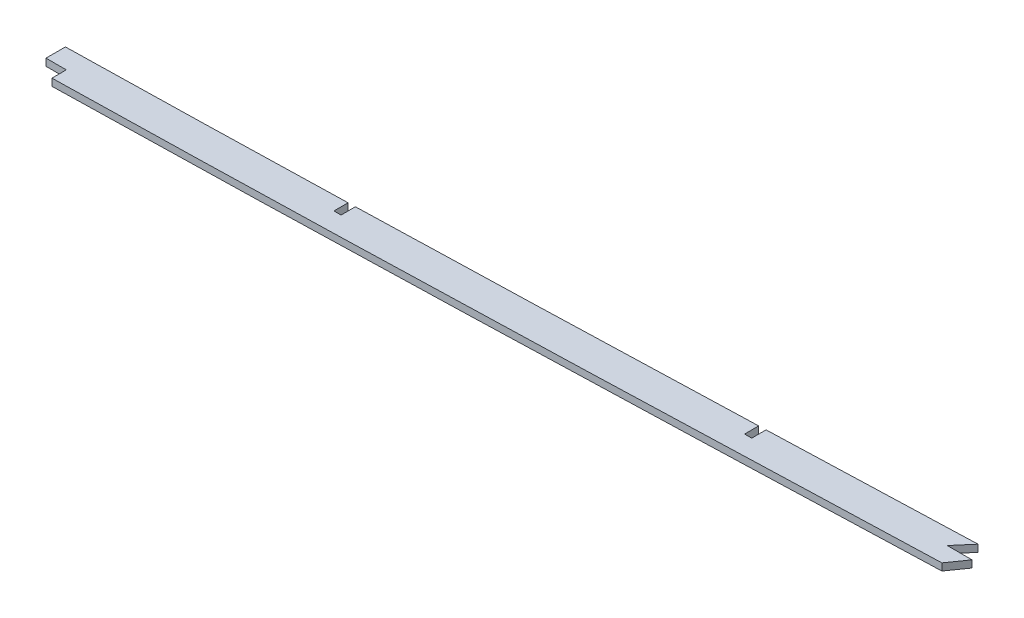
ISO-10303-21;
HEADER;
FILE_DESCRIPTION(('STEP AP214'),'2;1');
FILE_NAME('part.step','',(''),(''),'','','');
FILE_SCHEMA(('AUTOMOTIVE_DESIGN { 1 0 10303 214 1 1 1 1 }'));
ENDSEC;
DATA;
#1=APPLICATION_CONTEXT('core data for automotive mechanical design processes');
#2=APPLICATION_PROTOCOL_DEFINITION('international standard','automotive_design',2000,#1);
#3=PRODUCT_CONTEXT('',#1,'mechanical');
#4=PRODUCT('Part','Part','',(#3));
#5=PRODUCT_RELATED_PRODUCT_CATEGORY('part','',(#4));
#6=PRODUCT_DEFINITION_FORMATION('','',#4);
#7=PRODUCT_DEFINITION_CONTEXT('part definition',#1,'design');
#8=PRODUCT_DEFINITION('design','',#6,#7);
#9=PRODUCT_DEFINITION_SHAPE('','',#8);
#10=(LENGTH_UNIT() NAMED_UNIT(*) SI_UNIT(.MILLI.,.METRE.));
#11=(NAMED_UNIT(*) PLANE_ANGLE_UNIT() SI_UNIT($,.RADIAN.));
#12=(NAMED_UNIT(*) SI_UNIT($,.STERADIAN.) SOLID_ANGLE_UNIT());
#13=UNCERTAINTY_MEASURE_WITH_UNIT(LENGTH_MEASURE(1.E-05),#10,'distance_accuracy_value','');
#14=(GEOMETRIC_REPRESENTATION_CONTEXT(3) GLOBAL_UNCERTAINTY_ASSIGNED_CONTEXT((#13)) GLOBAL_UNIT_ASSIGNED_CONTEXT((#10,
#11,#12)) REPRESENTATION_CONTEXT('',''));
#15=CARTESIAN_POINT('',(0.,0.,0.));
#16=DIRECTION('',(0.,0.,1.));
#17=DIRECTION('',(1.,0.,0.));
#18=AXIS2_PLACEMENT_3D('',#15,#16,#17);
#19=CARTESIAN_POINT('',(616.337750913255,1.5875,99.0566103609531));
#20=CARTESIAN_POINT('',(647.76049660052,1.5875,99.0799542657679));
#21=CARTESIAN_POINT('',(694.87068034325,1.5875,98.960929783245));
#22=CARTESIAN_POINT('',(757.779786958647,1.5875,98.8040630386954));
#23=CARTESIAN_POINT('',(820.69045818609,1.5875,98.7653484328497));
#24=CARTESIAN_POINT('',(899.289299877085,1.5875,98.7967965825531));
#25=CARTESIAN_POINT('',(993.586772551322,1.5875,98.8129149281116));
#26=CARTESIAN_POINT('',(1087.93191592796,1.5875,98.7323574871025));
#27=CARTESIAN_POINT('',(1182.33953079348,1.5875,99.1244994990799));
#28=CARTESIAN_POINT('',(1276.65398068122,1.5875,99.8147611994573));
#29=CARTESIAN_POINT('',(1370.85083148495,1.5875,100.131815232071));
#30=CARTESIAN_POINT('',(1464.98207813977,1.5875,99.4108190462021));
#31=CARTESIAN_POINT('',(1590.54945268054,1.5875,97.1511702631117));
#32=CARTESIAN_POINT('',(1747.54008126415,1.5875,92.7833872927443));
#33=CARTESIAN_POINT('',(1904.58058478476,1.5875,87.4795525069474));
#34=CARTESIAN_POINT('',(2030.20455421821,1.5875,82.9558758992198));
#35=CARTESIAN_POINT('',(2092.98705848864,1.5875,80.5357121207426));
#36=CARTESIAN_POINT('',(2124.37829951673,1.5875,79.2527491986346));
#37=B_SPLINE_CURVE_WITH_KNOTS('',3,(#19,#20,#21,#22,#23,#24,#25,#26,#27,#28,#29,#30,#31,#32,#33,
#34,#35,#36),.UNSPECIFIED.,.F.,.F.,(4,1,1,1,1,1,1,1,1,1,1,1,1,1,1,4),(0.,0.0625,0.09375,0.125,
0.1875,0.25,0.3125,0.375,0.4375,0.5,0.5625,0.625,0.75,0.875,0.9375,1.),.UNSPECIFIED.);
#38=DIRECTION('',(0.,-1.,0.));
#39=VECTOR('',#38,1.);
#40=SURFACE_OF_LINEAR_EXTRUSION('',#37,#39);
#41=DIRECTION('',(0.,-1.,0.));
#42=VECTOR('',#41,1.);
#43=CARTESIAN_POINT('',(1526.14075421475,1.5875,98.2750837700095));
#44=LINE('',#43,#42);
#45=CARTESIAN_POINT('',(1526.14075421475,1.5875,98.2750837700095));
#46=VERTEX_POINT('',#45);
#47=CARTESIAN_POINT('',(1526.14075421818,-1.5875,98.2746680340119));
#48=VERTEX_POINT('',#47);
#49=EDGE_CURVE('E350',#46,#48,#44,.T.);
#50=ORIENTED_EDGE('',*,*,#49,.F.);
#51=CARTESIAN_POINT('',(1649.4125,1.5875,95.4347993689546));
#52=VERTEX_POINT('',#51);
#53=EDGE_CURVE('E189',#46,#52,#37,.T.);
#54=ORIENTED_EDGE('',*,*,#53,.T.);
#55=DIRECTION('',(0.,1.,0.));
#56=VECTOR('',#55,1.);
#57=CARTESIAN_POINT('',(1649.4125,-1.59253086897977,95.4347993689546));
#58=LINE('',#57,#56);
#59=CARTESIAN_POINT('',(1649.41250003793,-1.59001401585944,95.4347979480033));
#60=VERTEX_POINT('',#59);
#61=EDGE_CURVE('E301',#60,#52,#58,.T.);
#62=ORIENTED_EDGE('',*,*,#61,.F.);
#63=CARTESIAN_POINT('',(1649.41250015162,-1.5875,95.434799364902));
#64=CARTESIAN_POINT('',(1619.32619452746,-1.5875,96.2389509414082));
#65=CARTESIAN_POINT('',(1578.23463606875,-1.5875,97.2419981013641));
#66=CARTESIAN_POINT('',(1537.14666468491,-1.5875,98.0688089991976));
#67=CARTESIAN_POINT('',(1526.14075941432,-1.5875,98.2750836725584));
#68=B_SPLINE_CURVE_WITH_KNOTS('',3,(#63,#64,#65,#66,#67),.UNSPECIFIED.,.F.,.F.,(4,1,4),
(0.603087632694586,0.662976353685802,0.684888720991216),.UNSPECIFIED.);
#69=EDGE_CURVE('E194',#48,#60,#68,.F.);
#70=ORIENTED_EDGE('',*,*,#69,.F.);
#71=EDGE_LOOP('',(#50,#54,#62,#70));
#72=FACE_BOUND('',#71,.T.);
#73=ADVANCED_FACE('F40',(#72),#40,.T.);
#74=DIRECTION('',(0.,1.,0.));
#75=VECTOR('',#74,1.);
#76=CARTESIAN_POINT('',(1652.58750000975,-1.59253086897977,95.3496796564228));
#77=LINE('',#76,#75);
#78=CARTESIAN_POINT('',(1652.58750000655,-1.59001537226696,95.349679594262));
#79=VERTEX_POINT('',#78);
#80=CARTESIAN_POINT('',(1652.58750000975,1.5875,95.3496796564228));
#81=VERTEX_POINT('',#80);
#82=EDGE_CURVE('E411',#79,#81,#77,.T.);
#83=ORIENTED_EDGE('',*,*,#82,.T.);
#84=CARTESIAN_POINT('',(1827.2125,1.5875,90.049540748647));
#85=VERTEX_POINT('',#84);
#86=EDGE_CURVE('E186',#81,#85,#37,.T.);
#87=ORIENTED_EDGE('',*,*,#86,.T.);
#88=DIRECTION('',(0.,1.,0.));
#89=VECTOR('',#88,1.);
#90=CARTESIAN_POINT('',(1827.2125,-1.59253086897977,90.049540748647));
#91=LINE('',#90,#89);
#92=CARTESIAN_POINT('',(1827.2124999929,-1.58961570895085,90.0490866715874));
#93=VERTEX_POINT('',#92);
#94=EDGE_CURVE('E400',#93,#85,#91,.T.);
#95=ORIENTED_EDGE('',*,*,#94,.F.);
#96=CARTESIAN_POINT('',(1827.21252585751,-1.5875,90.0495398940868));
#97=CARTESIAN_POINT('',(1800.65723055116,-1.5875,90.9271611648872));
#98=CARTESIAN_POINT('',(1742.44397501687,-1.5875,92.7932630953193));
#99=CARTESIAN_POINT('',(1684.23928773812,-1.5875,94.4985561780462));
#100=CARTESIAN_POINT('',(1652.58750000669,-1.5875,95.3496796565051));
#101=B_SPLINE_CURVE_WITH_KNOTS('',3,(#96,#97,#98,#99,#100),.UNSPECIFIED.,.F.,.F.,(4,1,4),
(0.686995396099414,0.73984185977568,0.802846463676266),.UNSPECIFIED.);
#102=EDGE_CURVE('E457',#79,#93,#101,.F.);
#103=ORIENTED_EDGE('',*,*,#102,.F.);
#104=EDGE_LOOP('',(#83,#87,#95,#103));
#105=FACE_BOUND('',#104,.T.);
#106=ADVANCED_FACE('F276',(#105),#40,.T.);
#107=DIRECTION('',(0.,1.,0.));
#108=VECTOR('',#107,1.);
#109=CARTESIAN_POINT('',(1921.82414159405,-6.0325,86.8230267836531));
#110=LINE('',#109,#108);
#111=CARTESIAN_POINT('',(1921.8241647789,-1.5875,86.8229984790956));
#112=VERTEX_POINT('',#111);
#113=CARTESIAN_POINT('',(1921.82414159405,1.5875,86.8230267836531));
#114=VERTEX_POINT('',#113);
#115=EDGE_CURVE('E157',#112,#114,#110,.T.);
#116=ORIENTED_EDGE('',*,*,#115,.F.);
#117=CARTESIAN_POINT('',(1921.8241898876,-1.5875,86.8230250918403));
#118=CARTESIAN_POINT('',(1891.34525073032,-1.5875,87.890759066566));
#119=CARTESIAN_POINT('',(1860.86587594556,-1.5875,88.9348128638356));
#120=CARTESIAN_POINT('',(1830.38752627754,-1.5875,89.9444847258971));
#121=B_SPLINE_CURVE_WITH_KNOTS('',3,(#117,#118,#119,#120),.UNSPECIFIED.,.F.,.F.,(4,4),
(0.804952601579673,0.865606008921044),.UNSPECIFIED.);
#122=CARTESIAN_POINT('',(1830.38749999487,-1.58961033761423,89.944024452022));
#123=VERTEX_POINT('',#122);
#124=EDGE_CURVE('E300',#123,#112,#121,.F.);
#125=ORIENTED_EDGE('',*,*,#124,.F.);
#126=DIRECTION('',(0.,1.,0.));
#127=VECTOR('',#126,1.);
#128=CARTESIAN_POINT('',(1830.38749999999,-1.59253086897977,89.9444855964069));
#129=LINE('',#128,#127);
#130=CARTESIAN_POINT('',(1830.38749999999,1.5875,89.9444855964069));
#131=VERTEX_POINT('',#130);
#132=EDGE_CURVE('E184',#123,#131,#129,.T.);
#133=ORIENTED_EDGE('',*,*,#132,.T.);
#134=EDGE_CURVE('E176',#131,#114,#37,.T.);
#135=ORIENTED_EDGE('',*,*,#134,.T.);
#136=EDGE_LOOP('',(#116,#125,#133,#135));
#137=FACE_BOUND('',#136,.T.);
#138=ADVANCED_FACE('F183',(#137),#40,.T.);
#139=CARTESIAN_POINT('',(616.326429146063,1.5875,114.296606155493));
#140=CARTESIAN_POINT('',(632.046217380175,1.5875,114.30828435968));
#141=CARTESIAN_POINT('',(647.765968153244,1.5875,114.29677439422));
#142=CARTESIAN_POINT('',(679.205420392794,1.5875,114.24323397025));
#143=CARTESIAN_POINT('',(694.925123066751,1.5875,114.201950932506));
#144=CARTESIAN_POINT('',(726.364532124698,1.5875,114.121681346548));
#145=CARTESIAN_POINT('',(742.084243399862,1.5875,114.083543006226));
#146=CARTESIAN_POINT('',(773.523671882744,1.5875,114.034083388907));
#147=CARTESIAN_POINT('',(789.243390213417,1.5875,114.023396075664));
#148=CARTESIAN_POINT('',(820.682831324826,1.5875,114.017303041489));
#149=CARTESIAN_POINT('',(836.402553623007,1.5875,114.020240225192));
#150=CARTESIAN_POINT('',(867.841997842806,1.5875,114.024821457385));
#151=CARTESIAN_POINT('',(883.561720421664,1.5875,114.028722489467));
#152=CARTESIAN_POINT('',(915.001165910892,1.5875,114.037662965197));
#153=CARTESIAN_POINT('',(930.720888644625,1.5875,114.042095840025));
#154=CARTESIAN_POINT('',(962.160332217753,1.5875,114.044456392842));
#155=CARTESIAN_POINT('',(977.880053630737,1.5875,114.042025852399));
#156=CARTESIAN_POINT('',(1025.03924062521,1.5875,114.02635266127));
#157=CARTESIAN_POINT('',(1056.47872633141,1.5875,114.001081239981));
#158=CARTESIAN_POINT('',(1103.63774370583,1.5875,114.076141518065));
#159=CARTESIAN_POINT('',(1119.35738201238,1.5875,114.119430036675));
#160=CARTESIAN_POINT('',(1150.79658971577,1.5875,114.242868384306));
#161=CARTESIAN_POINT('',(1166.51615941665,1.5875,114.322855573181));
#162=CARTESIAN_POINT('',(1213.67480633689,1.5875,114.596079866728));
#163=CARTESIAN_POINT('',(1245.11381381393,1.5875,114.824335417931));
#164=CARTESIAN_POINT('',(1307.99206873737,1.5875,115.160349224997));
#165=CARTESIAN_POINT('',(1339.43132783757,1.5875,115.262775920084));
#166=CARTESIAN_POINT('',(1386.59071758969,1.5875,115.166774968219));
#167=CARTESIAN_POINT('',(1402.31059775436,1.5875,115.09313610926));
#168=CARTESIAN_POINT('',(1433.75053971329,1.5875,114.855373393272));
#169=CARTESIAN_POINT('',(1449.46971812607,1.5875,114.691491377402));
#170=CARTESIAN_POINT('',(1480.90524720166,1.5875,114.282993412757));
#171=CARTESIAN_POINT('',(1496.62184273389,1.5875,114.038617844409));
#172=CARTESIAN_POINT('',(1528.05323424889,1.5875,113.488096449305));
#173=CARTESIAN_POINT('',(1543.76803918056,1.5875,113.182257797232));
#174=CARTESIAN_POINT('',(1590.91012672281,1.5875,112.184857954141));
#175=CARTESIAN_POINT('',(1622.33508716355,1.5875,111.413587350345));
#176=CARTESIAN_POINT('',(1685.18062244756,1.5875,109.720508746898));
#177=CARTESIAN_POINT('',(1716.60120600918,1.5875,108.799000007991));
#178=CARTESIAN_POINT('',(1779.43954296825,1.5875,106.858836007746));
#179=CARTESIAN_POINT('',(1810.85730451947,1.5875,105.840460627799));
#180=CARTESIAN_POINT('',(1873.69102784609,1.5875,103.741931839349));
#181=CARTESIAN_POINT('',(1905.10699770462,1.5875,102.662055887814));
#182=CARTESIAN_POINT('',(1967.93740090808,1.5875,100.449562537391));
#183=CARTESIAN_POINT('',(1999.35184226252,1.5875,99.3172200683351));
#184=CARTESIAN_POINT('',(2062.17844269824,1.5875,96.9741951872324));
#185=CARTESIAN_POINT('',(2093.59060920955,1.5875,95.7637678134024));
#186=CARTESIAN_POINT('',(2125.00064017427,1.5875,94.4800369448474));
#187=B_SPLINE_CURVE_WITH_KNOTS('',3,(#139,#140,#141,#142,#143,#144,#145,#146,#147,#148,#149,
#150,#151,#152,#153,#154,#155,#156,#157,#158,#159,#160,#161,#162,#163,#164,#165,#166,#167,#168,
#169,#170,#171,#172,#173,#174,#175,#176,#177,#178,#179,#180,#181,#182,#183,#184,#185,#186),
.UNSPECIFIED.,.F.,.F.,(4,2,2,2,2,2,2,2,2,2,2,2,2,2,2,2,2,2,2,2,2,2,2,4),(0.,0.0312499999999999,
0.0624999999999998,0.0937499999999997,0.125,0.156249999999999,0.187499999999999,
0.218749999999999,0.249999999999999,0.312499999999999,0.343749999999999,0.374999999999999,
0.437499999999998,0.499999999999998,0.531249999999998,0.562499999999998,0.593749999999999,
0.624999999999999,0.687499999999999,0.749999999999999,0.812499999999999,0.875,0.9375,1.),.UNSPECIFIED.);
#188=DIRECTION('',(0.,-1.,0.));
#189=VECTOR('',#188,1.);
#190=SURFACE_OF_LINEAR_EXTRUSION('',#187,#189);
#191=CARTESIAN_POINT('',(1535.19541771725,-1.5875,113.341877072037));
#192=CARTESIAN_POINT('',(1543.29118430236,-1.5875,113.185275444116));
#193=CARTESIAN_POINT('',(1551.38672927258,-1.5875,113.021066795762));
#194=CARTESIAN_POINT('',(1590.91012672281,-1.5875,112.184857954141));
#195=CARTESIAN_POINT('',(1622.33508716355,-1.5875,111.413587350345));
#196=CARTESIAN_POINT('',(1685.18062244756,-1.5875,109.720508746898));
#197=CARTESIAN_POINT('',(1716.60120600918,-1.5875,108.799000007991));
#198=CARTESIAN_POINT('',(1779.43954296825,-1.5875,106.858836007746));
#199=CARTESIAN_POINT('',(1810.85730451947,-1.5875,105.840460627799));
#200=CARTESIAN_POINT('',(1868.5201102714,-1.5875,103.914630810836));
#201=CARTESIAN_POINT('',(1894.76543196144,-1.5875,103.016701306731));
#202=CARTESIAN_POINT('',(1921.01020328629,-1.5875,102.099880296036));
#203=B_SPLINE_CURVE_WITH_KNOTS('',3,(#191,#192,#193,#194,#195,#196,#197,#198,#199,#200,#201,
#202),.UNSPECIFIED.,.F.,.F.,(4,2,2,2,2,4),(0.60890105149907,0.624999999999999,0.687499999999999,
0.749999999999999,0.812499999999999,0.864713092546239),.UNSPECIFIED.);
#204=CARTESIAN_POINT('',(1535.1954174423,-1.5875,113.341862857388));
#205=VERTEX_POINT('',#204);
#206=CARTESIAN_POINT('',(1921.01019968797,-1.5875,102.099880421738));
#207=VERTEX_POINT('',#206);
#208=EDGE_CURVE('E294',#205,#207,#203,.T.);
#209=ORIENTED_EDGE('',*,*,#208,.T.);
#210=DIRECTION('',(0.,1.,0.));
#211=VECTOR('',#210,1.);
#212=CARTESIAN_POINT('',(1921.01019968797,-6.0325,102.099880421738));
#213=LINE('',#212,#211);
#214=CARTESIAN_POINT('',(1921.01019968797,1.5875,102.099880421738));
#215=VERTEX_POINT('',#214);
#216=EDGE_CURVE('E295',#207,#215,#213,.T.);
#217=ORIENTED_EDGE('',*,*,#216,.T.);
#218=CARTESIAN_POINT('',(1921.01020341492,1.5875,102.099880291542));
#219=CARTESIAN_POINT('',(1894.7654320472,1.5875,103.016701303797));
#220=CARTESIAN_POINT('',(1868.52011031428,1.5875,103.914630809404));
#221=CARTESIAN_POINT('',(1810.85730451947,1.5875,105.840460627799));
#222=CARTESIAN_POINT('',(1779.43954296825,1.5875,106.858836007746));
#223=CARTESIAN_POINT('',(1716.60120600918,1.5875,108.799000007991));
#224=CARTESIAN_POINT('',(1685.18062244756,1.5875,109.720508746898));
#225=CARTESIAN_POINT('',(1622.33508716355,1.5875,111.413587350345));
#226=CARTESIAN_POINT('',(1590.91012672281,1.5875,112.184857954141));
#227=CARTESIAN_POINT('',(1551.38672927229,1.5875,113.021066795768));
#228=CARTESIAN_POINT('',(1543.29118430179,1.5875,113.185275444127));
#229=CARTESIAN_POINT('',(1535.19541771639,1.5875,113.341877072053));
#230=B_SPLINE_CURVE_WITH_KNOTS('',3,(#218,#219,#220,#221,#222,#223,#224,#225,#226,#227,#228,
#229),.UNSPECIFIED.,.F.,.F.,(4,2,2,2,2,4),(0.608901051498502,0.661114144130043,
0.723614144130043,0.786114144130043,0.848614144130043,0.86471309263154),.UNSPECIFIED.);
#231=CARTESIAN_POINT('',(1535.1954174423,1.5875,113.341869989709));
#232=VERTEX_POINT('',#231);
#233=EDGE_CURVE('E187',#232,#215,#230,.F.);
#234=ORIENTED_EDGE('',*,*,#233,.F.);
#235=DIRECTION('',(0.,-1.,0.));
#236=VECTOR('',#235,1.);
#237=CARTESIAN_POINT('',(1535.1954174423,1.5875,113.341877077355));
#238=LINE('',#237,#236);
#239=EDGE_CURVE('E296',#232,#205,#238,.T.);
#240=ORIENTED_EDGE('',*,*,#239,.T.);
#241=EDGE_LOOP('',(#209,#217,#234,#240));
#242=FACE_BOUND('',#241,.T.);
#243=ADVANCED_FACE('F42',(#242),#190,.F.);
#244=CARTESIAN_POINT('',(0.,1.5875,0.));
#245=DIRECTION('',(0.,1.,0.));
#246=DIRECTION('',(0.,0.,1.));
#247=AXIS2_PLACEMENT_3D('',#244,#245,#246);
#248=PLANE('',#247);
#249=DIRECTION('',(-0.573743913776215,0.,0.819034749815142));
#250=VECTOR('',#249,1.);
#251=CARTESIAN_POINT('',(1926.53005457574,1.5875,94.2201402476524));
#252=LINE('',#251,#250);
#253=CARTESIAN_POINT('',(1926.53005457574,1.5875,94.2201402476524));
#254=VERTEX_POINT('',#253);
#255=EDGE_CURVE('E169',#254,#215,#252,.T.);
#256=ORIENTED_EDGE('',*,*,#255,.F.);
#257=DIRECTION('',(1.,0.,0.));
#258=VECTOR('',#257,1.);
#259=CARTESIAN_POINT('',(1915.4903448002,1.5875,94.2201402476524));
#260=LINE('',#259,#258);
#261=CARTESIAN_POINT('',(1915.4903448002,1.5875,94.2201402476524));
#262=VERTEX_POINT('',#261);
#263=EDGE_CURVE('E178',#262,#254,#260,.T.);
#264=ORIENTED_EDGE('',*,*,#263,.F.);
#265=DIRECTION('',(-0.650401410500427,0.,0.759590682683151));
#266=VECTOR('',#265,1.);
#267=CARTESIAN_POINT('',(1921.82414159405,1.5875,86.8230267836531));
#268=LINE('',#267,#266);
#269=EDGE_CURVE('E160',#114,#262,#268,.T.);
#270=ORIENTED_EDGE('',*,*,#269,.F.);
#271=ORIENTED_EDGE('',*,*,#134,.F.);
#272=DIRECTION('',(0.,0.,-1.));
#273=VECTOR('',#272,1.);
#274=CARTESIAN_POINT('',(1830.3875,1.5875,-6.3478943601493E-11));
#275=LINE('',#274,#273);
#276=CARTESIAN_POINT('',(1830.3875,1.5875,96.3470444015544));
#277=VERTEX_POINT('',#276);
#278=EDGE_CURVE('E417',#277,#131,#275,.T.);
#279=ORIENTED_EDGE('',*,*,#278,.F.);
#280=DIRECTION('',(1.,0.,0.));
#281=VECTOR('',#280,1.);
#282=CARTESIAN_POINT('',(0.,1.5875,96.3470444015544));
#283=LINE('',#282,#281);
#284=CARTESIAN_POINT('',(1827.2125,1.5875,96.3470444015544));
#285=VERTEX_POINT('',#284);
#286=EDGE_CURVE('E385',#285,#277,#283,.T.);
#287=ORIENTED_EDGE('',*,*,#286,.F.);
#288=DIRECTION('',(0.,0.,1.));
#289=VECTOR('',#288,1.);
#290=CARTESIAN_POINT('',(1827.2125,1.5875,0.));
#291=LINE('',#290,#289);
#292=EDGE_CURVE('E381',#85,#285,#291,.T.);
#293=ORIENTED_EDGE('',*,*,#292,.F.);
#294=ORIENTED_EDGE('',*,*,#86,.F.);
#295=DIRECTION('',(0.,0.,-1.));
#296=VECTOR('',#295,1.);
#297=CARTESIAN_POINT('',(1652.5875,1.5875,0.));
#298=LINE('',#297,#296);
#299=CARTESIAN_POINT('',(1652.5875,1.5875,101.742303829854));
#300=VERTEX_POINT('',#299);
#301=EDGE_CURVE('E404',#300,#81,#298,.T.);
#302=ORIENTED_EDGE('',*,*,#301,.F.);
#303=DIRECTION('',(1.,0.,0.));
#304=VECTOR('',#303,1.);
#305=CARTESIAN_POINT('',(0.,1.5875,101.742303829854));
#306=LINE('',#305,#304);
#307=CARTESIAN_POINT('',(1649.4125,1.5875,101.742303829854));
#308=VERTEX_POINT('',#307);
#309=EDGE_CURVE('E399',#308,#300,#306,.T.);
#310=ORIENTED_EDGE('',*,*,#309,.F.);
#311=DIRECTION('',(0.,0.,1.));
#312=VECTOR('',#311,1.);
#313=CARTESIAN_POINT('',(1649.4125,1.5875,0.));
#314=LINE('',#313,#312);
#315=EDGE_CURVE('E395',#52,#308,#314,.T.);
#316=ORIENTED_EDGE('',*,*,#315,.F.);
#317=ORIENTED_EDGE('',*,*,#53,.F.);
#318=DIRECTION('',(0.,0.,-1.));
#319=VECTOR('',#318,1.);
#320=CARTESIAN_POINT('',(1526.14075421475,1.5875,98.2750837700095));
#321=LINE('',#320,#319);
#322=CARTESIAN_POINT('',(1526.14075421475,1.5875,106.937874616711));
#323=VERTEX_POINT('',#322);
#324=EDGE_CURVE('E358',#323,#46,#321,.T.);
#325=ORIENTED_EDGE('',*,*,#324,.F.);
#326=DIRECTION('',(-1.,0.,0.));
#327=VECTOR('',#326,1.);
#328=CARTESIAN_POINT('',(1526.14075421475,1.5875,106.937874616711));
#329=LINE('',#328,#327);
#330=CARTESIAN_POINT('',(1535.1954174423,1.5875,106.937874616711));
#331=VERTEX_POINT('',#330);
#332=EDGE_CURVE('E354',#331,#323,#329,.T.);
#333=ORIENTED_EDGE('',*,*,#332,.F.);
#334=DIRECTION('',(0.,0.,-1.));
#335=VECTOR('',#334,1.);
#336=CARTESIAN_POINT('',(1535.1954174423,1.5875,106.937874616711));
#337=LINE('',#336,#335);
#338=EDGE_CURVE('E347',#232,#331,#337,.T.);
#339=ORIENTED_EDGE('',*,*,#338,.F.);
#340=ORIENTED_EDGE('',*,*,#233,.T.);
#341=EDGE_LOOP('',(#256,#264,#270,#271,#279,#287,#293,#294,#302,#310,#316,#317,#325,#333,#339,#340));
#342=FACE_BOUND('',#341,.T.);
#343=ADVANCED_FACE('F174',(#342),#248,.T.);
#344=CARTESIAN_POINT('',(0.,-1.5875,0.));
#345=DIRECTION('',(0.,1.,0.));
#346=DIRECTION('',(0.,0.,1.));
#347=AXIS2_PLACEMENT_3D('',#344,#345,#346);
#348=PLANE('',#347);
#349=DIRECTION('',(1.,0.,0.));
#350=VECTOR('',#349,1.);
#351=CARTESIAN_POINT('',(0.,-1.5875,94.2201402476524));
#352=LINE('',#351,#350);
#353=CARTESIAN_POINT('',(1915.4903448002,-1.5875,94.2201402476525));
#354=VERTEX_POINT('',#353);
#355=CARTESIAN_POINT('',(1926.53005457574,-1.5875,94.2201402476524));
#356=VERTEX_POINT('',#355);
#357=EDGE_CURVE('E53',#354,#356,#352,.T.);
#358=ORIENTED_EDGE('',*,*,#357,.T.);
#359=DIRECTION('',(-0.573743913776215,0.,0.819034749815142));
#360=VECTOR('',#359,1.);
#361=CARTESIAN_POINT('',(1336.62645727406,-1.5875,936.323269588185));
#362=LINE('',#361,#360);
#363=EDGE_CURVE('E11',#356,#207,#362,.T.);
#364=ORIENTED_EDGE('',*,*,#363,.T.);
#365=ORIENTED_EDGE('',*,*,#208,.F.);
#366=DIRECTION('',(0.,0.,-1.));
#367=VECTOR('',#366,1.);
#368=CARTESIAN_POINT('',(1535.1954174423,-1.5875,0.));
#369=LINE('',#368,#367);
#370=CARTESIAN_POINT('',(1535.1954174423,-1.5875,106.937874616711));
#371=VERTEX_POINT('',#370);
#372=EDGE_CURVE('E240',#205,#371,#369,.T.);
#373=ORIENTED_EDGE('',*,*,#372,.T.);
#374=DIRECTION('',(-1.,0.,0.));
#375=VECTOR('',#374,1.);
#376=CARTESIAN_POINT('',(0.,-1.5875,106.937874616711));
#377=LINE('',#376,#375);
#378=CARTESIAN_POINT('',(1526.14075421475,-1.5875,106.937874616711));
#379=VERTEX_POINT('',#378);
#380=EDGE_CURVE('E340',#371,#379,#377,.T.);
#381=ORIENTED_EDGE('',*,*,#380,.T.);
#382=DIRECTION('',(0.,0.,-1.));
#383=VECTOR('',#382,1.);
#384=CARTESIAN_POINT('',(1526.14075421475,-1.5875,0.));
#385=LINE('',#384,#383);
#386=EDGE_CURVE('E335',#379,#48,#385,.T.);
#387=ORIENTED_EDGE('',*,*,#386,.T.);
#388=ORIENTED_EDGE('',*,*,#69,.T.);
#389=DIRECTION('',(0.,0.,1.));
#390=VECTOR('',#389,1.);
#391=CARTESIAN_POINT('',(1649.4125,-1.5875,0.));
#392=LINE('',#391,#390);
#393=CARTESIAN_POINT('',(1649.4125,-1.5875,101.742303829854));
#394=VERTEX_POINT('',#393);
#395=EDGE_CURVE('E234',#60,#394,#392,.T.);
#396=ORIENTED_EDGE('',*,*,#395,.T.);
#397=DIRECTION('',(1.,0.,0.));
#398=VECTOR('',#397,1.);
#399=CARTESIAN_POINT('',(0.,-1.5875,101.742303829854));
#400=LINE('',#399,#398);
#401=CARTESIAN_POINT('',(1652.5875,-1.5875,101.742303829854));
#402=VERTEX_POINT('',#401);
#403=EDGE_CURVE('E224',#394,#402,#400,.T.);
#404=ORIENTED_EDGE('',*,*,#403,.T.);
#405=DIRECTION('',(0.,0.,-1.));
#406=VECTOR('',#405,1.);
#407=CARTESIAN_POINT('',(1652.5875,-1.5875,0.));
#408=LINE('',#407,#406);
#409=EDGE_CURVE('E230',#402,#79,#408,.T.);
#410=ORIENTED_EDGE('',*,*,#409,.T.);
#411=ORIENTED_EDGE('',*,*,#102,.T.);
#412=DIRECTION('',(0.,0.,1.));
#413=VECTOR('',#412,1.);
#414=CARTESIAN_POINT('',(1827.2125,-1.5875,0.));
#415=LINE('',#414,#413);
#416=CARTESIAN_POINT('',(1827.2125,-1.5875,96.3470444015544));
#417=VERTEX_POINT('',#416);
#418=EDGE_CURVE('E214',#93,#417,#415,.T.);
#419=ORIENTED_EDGE('',*,*,#418,.T.);
#420=DIRECTION('',(1.,0.,0.));
#421=VECTOR('',#420,1.);
#422=CARTESIAN_POINT('',(0.,-1.5875,96.3470444015544));
#423=LINE('',#422,#421);
#424=CARTESIAN_POINT('',(1830.3875,-1.5875,96.3470444015544));
#425=VERTEX_POINT('',#424);
#426=EDGE_CURVE('E200',#417,#425,#423,.T.);
#427=ORIENTED_EDGE('',*,*,#426,.T.);
#428=DIRECTION('',(0.,0.,-1.));
#429=VECTOR('',#428,1.);
#430=CARTESIAN_POINT('',(1830.3875,-1.5875,-6.3478943601493E-11));
#431=LINE('',#430,#429);
#432=EDGE_CURVE('E208',#425,#123,#431,.T.);
#433=ORIENTED_EDGE('',*,*,#432,.T.);
#434=ORIENTED_EDGE('',*,*,#124,.T.);
#435=DIRECTION('',(-0.650401410500427,0.,0.759590682683151));
#436=VECTOR('',#435,1.);
#437=CARTESIAN_POINT('',(1151.74420802777,-1.5875,986.183841527493));
#438=LINE('',#437,#436);
#439=EDGE_CURVE('E163',#112,#354,#438,.T.);
#440=ORIENTED_EDGE('',*,*,#439,.T.);
#441=EDGE_LOOP('',(#358,#364,#365,#373,#381,#387,#388,#396,#404,#410,#411,#419,#427,#433,#434,#440));
#442=FACE_BOUND('',#441,.T.);
#443=ADVANCED_FACE('F261',(#442),#348,.F.);
#444=CARTESIAN_POINT('',(1827.2125,-1.59253086897977,0.));
#445=DIRECTION('',(-1.,0.,0.));
#446=DIRECTION('',(0.,0.,1.));
#447=AXIS2_PLACEMENT_3D('',#444,#445,#446);
#448=PLANE('',#447);
#449=ORIENTED_EDGE('',*,*,#94,.T.);
#450=ORIENTED_EDGE('',*,*,#292,.T.);
#451=DIRECTION('',(0.,1.,0.));
#452=VECTOR('',#451,1.);
#453=CARTESIAN_POINT('',(1827.2125,-1.59253086897977,96.3470444015544));
#454=LINE('',#453,#452);
#455=EDGE_CURVE('E420',#417,#285,#454,.T.);
#456=ORIENTED_EDGE('',*,*,#455,.F.);
#457=ORIENTED_EDGE('',*,*,#418,.F.);
#458=EDGE_LOOP('',(#449,#450,#456,#457));
#459=FACE_BOUND('',#458,.T.);
#460=ADVANCED_FACE('F270',(#459),#448,.F.);
#461=CARTESIAN_POINT('',(1830.3875,-1.59253086897977,-6.3478943601493E-11));
#462=DIRECTION('',(1.,0.,0.));
#463=DIRECTION('',(0.,0.,-1.));
#464=AXIS2_PLACEMENT_3D('',#461,#462,#463);
#465=PLANE('',#464);
#466=DIRECTION('',(0.,1.,0.));
#467=VECTOR('',#466,1.);
#468=CARTESIAN_POINT('',(1830.3875,-1.59253086897977,96.3470444015544));
#469=LINE('',#468,#467);
#470=EDGE_CURVE('E421',#425,#277,#469,.T.);
#471=ORIENTED_EDGE('',*,*,#470,.T.);
#472=ORIENTED_EDGE('',*,*,#278,.T.);
#473=ORIENTED_EDGE('',*,*,#132,.F.);
#474=ORIENTED_EDGE('',*,*,#432,.F.);
#475=EDGE_LOOP('',(#471,#472,#473,#474));
#476=FACE_BOUND('',#475,.T.);
#477=ADVANCED_FACE('F476',(#476),#465,.F.);
#478=CARTESIAN_POINT('',(0.,-1.59253086897977,96.3470444015544));
#479=DIRECTION('',(0.,0.,1.));
#480=DIRECTION('',(1.,0.,0.));
#481=AXIS2_PLACEMENT_3D('',#478,#479,#480);
#482=PLANE('',#481);
#483=ORIENTED_EDGE('',*,*,#455,.T.);
#484=ORIENTED_EDGE('',*,*,#286,.T.);
#485=ORIENTED_EDGE('',*,*,#470,.F.);
#486=ORIENTED_EDGE('',*,*,#426,.F.);
#487=EDGE_LOOP('',(#483,#484,#485,#486));
#488=FACE_BOUND('',#487,.T.);
#489=ADVANCED_FACE('F469',(#488),#482,.F.);
#490=CARTESIAN_POINT('',(1649.4125,-1.59253086897977,0.));
#491=DIRECTION('',(-1.,0.,0.));
#492=DIRECTION('',(0.,0.,1.));
#493=AXIS2_PLACEMENT_3D('',#490,#491,#492);
#494=PLANE('',#493);
#495=ORIENTED_EDGE('',*,*,#61,.T.);
#496=ORIENTED_EDGE('',*,*,#315,.T.);
#497=DIRECTION('',(0.,1.,0.));
#498=VECTOR('',#497,1.);
#499=CARTESIAN_POINT('',(1649.4125,-1.59253086897977,101.742303829854));
#500=LINE('',#499,#498);
#501=EDGE_CURVE('E407',#394,#308,#500,.T.);
#502=ORIENTED_EDGE('',*,*,#501,.F.);
#503=ORIENTED_EDGE('',*,*,#395,.F.);
#504=EDGE_LOOP('',(#495,#496,#502,#503));
#505=FACE_BOUND('',#504,.T.);
#506=ADVANCED_FACE('F466',(#505),#494,.F.);
#507=CARTESIAN_POINT('',(1652.5875,-1.59253086897977,0.));
#508=DIRECTION('',(1.,0.,0.));
#509=DIRECTION('',(0.,0.,-1.));
#510=AXIS2_PLACEMENT_3D('',#507,#508,#509);
#511=PLANE('',#510);
#512=DIRECTION('',(0.,1.,0.));
#513=VECTOR('',#512,1.);
#514=CARTESIAN_POINT('',(1652.5875,-1.59253086897977,101.742303829854));
#515=LINE('',#514,#513);
#516=EDGE_CURVE('E408',#402,#300,#515,.T.);
#517=ORIENTED_EDGE('',*,*,#516,.T.);
#518=ORIENTED_EDGE('',*,*,#301,.T.);
#519=ORIENTED_EDGE('',*,*,#82,.F.);
#520=ORIENTED_EDGE('',*,*,#409,.F.);
#521=EDGE_LOOP('',(#517,#518,#519,#520));
#522=FACE_BOUND('',#521,.T.);
#523=ADVANCED_FACE('F461',(#522),#511,.F.);
#524=CARTESIAN_POINT('',(0.,-1.59253086897977,101.742303829854));
#525=DIRECTION('',(0.,0.,1.));
#526=DIRECTION('',(1.,0.,0.));
#527=AXIS2_PLACEMENT_3D('',#524,#525,#526);
#528=PLANE('',#527);
#529=ORIENTED_EDGE('',*,*,#501,.T.);
#530=ORIENTED_EDGE('',*,*,#309,.T.);
#531=ORIENTED_EDGE('',*,*,#516,.F.);
#532=ORIENTED_EDGE('',*,*,#403,.F.);
#533=EDGE_LOOP('',(#529,#530,#531,#532));
#534=FACE_BOUND('',#533,.T.);
#535=ADVANCED_FACE('F464',(#534),#528,.F.);
#536=CARTESIAN_POINT('',(1526.14075421475,-6.0325,106.937874616711));
#537=DIRECTION('',(0.,0.,-1.));
#538=DIRECTION('',(-1.,0.,0.));
#539=AXIS2_PLACEMENT_3D('',#536,#537,#538);
#540=PLANE('',#539);
#541=DIRECTION('',(0.,1.,0.));
#542=VECTOR('',#541,1.);
#543=CARTESIAN_POINT('',(1535.1954174423,-6.0325,106.937874616711));
#544=LINE('',#543,#542);
#545=EDGE_CURVE('E69',#371,#331,#544,.T.);
#546=ORIENTED_EDGE('',*,*,#545,.T.);
#547=ORIENTED_EDGE('',*,*,#332,.T.);
#548=DIRECTION('',(0.,1.,0.));
#549=VECTOR('',#548,1.);
#550=CARTESIAN_POINT('',(1526.14075421475,-6.0325,106.937874616711));
#551=LINE('',#550,#549);
#552=EDGE_CURVE('E180',#379,#323,#551,.T.);
#553=ORIENTED_EDGE('',*,*,#552,.F.);
#554=ORIENTED_EDGE('',*,*,#380,.F.);
#555=EDGE_LOOP('',(#546,#547,#553,#554));
#556=FACE_BOUND('',#555,.T.);
#557=ADVANCED_FACE('F377',(#556),#540,.F.);
#558=CARTESIAN_POINT('',(1535.1954174423,-6.0325,106.937874616711));
#559=DIRECTION('',(1.,0.,0.));
#560=DIRECTION('',(0.,0.,-1.));
#561=AXIS2_PLACEMENT_3D('',#558,#559,#560);
#562=PLANE('',#561);
#563=ORIENTED_EDGE('',*,*,#338,.T.);
#564=ORIENTED_EDGE('',*,*,#545,.F.);
#565=ORIENTED_EDGE('',*,*,#372,.F.);
#566=ORIENTED_EDGE('',*,*,#239,.F.);
#567=EDGE_LOOP('',(#563,#564,#565,#566));
#568=FACE_BOUND('',#567,.T.);
#569=ADVANCED_FACE('F346',(#568),#562,.F.);
#570=CARTESIAN_POINT('',(1526.14075421475,-6.0325,98.2750837700095));
#571=DIRECTION('',(1.,0.,0.));
#572=DIRECTION('',(0.,0.,-1.));
#573=AXIS2_PLACEMENT_3D('',#570,#571,#572);
#574=PLANE('',#573);
#575=ORIENTED_EDGE('',*,*,#49,.T.);
#576=ORIENTED_EDGE('',*,*,#386,.F.);
#577=ORIENTED_EDGE('',*,*,#552,.T.);
#578=ORIENTED_EDGE('',*,*,#324,.T.);
#579=EDGE_LOOP('',(#575,#576,#577,#578));
#580=FACE_BOUND('',#579,.T.);
#581=ADVANCED_FACE('F379',(#580),#574,.F.);
#582=CARTESIAN_POINT('',(1926.53005457574,-6.0325,94.2201402476524));
#583=DIRECTION('',(-0.819034749815142,0.,-0.573743913776215));
#584=DIRECTION('',(-0.573743913776215,0.,0.819034749815142));
#585=AXIS2_PLACEMENT_3D('',#582,#583,#584);
#586=PLANE('',#585);
#587=DIRECTION('',(0.,1.,0.));
#588=VECTOR('',#587,1.);
#589=CARTESIAN_POINT('',(1926.53005457574,-6.0325,94.2201402476524));
#590=LINE('',#589,#588);
#591=EDGE_CURVE('E394',#356,#254,#590,.T.);
#592=ORIENTED_EDGE('',*,*,#591,.T.);
#593=ORIENTED_EDGE('',*,*,#255,.T.);
#594=ORIENTED_EDGE('',*,*,#216,.F.);
#595=ORIENTED_EDGE('',*,*,#363,.F.);
#596=EDGE_LOOP('',(#592,#593,#594,#595));
#597=FACE_BOUND('',#596,.T.);
#598=ADVANCED_FACE('F535',(#597),#586,.F.);
#599=CARTESIAN_POINT('',(1915.4903448002,-6.0325,94.2201402476524));
#600=DIRECTION('',(0.,0.,1.));
#601=DIRECTION('',(1.,0.,0.));
#602=AXIS2_PLACEMENT_3D('',#599,#600,#601);
#603=PLANE('',#602);
#604=DIRECTION('',(0.,1.,0.));
#605=VECTOR('',#604,1.);
#606=CARTESIAN_POINT('',(1915.4903448002,-6.0325,94.2201402476524));
#607=LINE('',#606,#605);
#608=EDGE_CURVE('E61',#354,#262,#607,.T.);
#609=ORIENTED_EDGE('',*,*,#608,.T.);
#610=ORIENTED_EDGE('',*,*,#263,.T.);
#611=ORIENTED_EDGE('',*,*,#591,.F.);
#612=ORIENTED_EDGE('',*,*,#357,.F.);
#613=EDGE_LOOP('',(#609,#610,#611,#612));
#614=FACE_BOUND('',#613,.T.);
#615=ADVANCED_FACE('F542',(#614),#603,.F.);
#616=CARTESIAN_POINT('',(1921.82414159405,-6.0325,86.8230267836531));
#617=DIRECTION('',(-0.759590682683151,0.,-0.650401410500427));
#618=DIRECTION('',(-0.650401410500427,0.,0.759590682683151));
#619=AXIS2_PLACEMENT_3D('',#616,#617,#618);
#620=PLANE('',#619);
#621=ORIENTED_EDGE('',*,*,#115,.T.);
#622=ORIENTED_EDGE('',*,*,#269,.T.);
#623=ORIENTED_EDGE('',*,*,#608,.F.);
#624=ORIENTED_EDGE('',*,*,#439,.F.);
#625=EDGE_LOOP('',(#621,#622,#623,#624));
#626=FACE_BOUND('',#625,.T.);
#627=ADVANCED_FACE('F159',(#626),#620,.F.);
#628=CLOSED_SHELL('',(#73,#106,#138,#243,#343,#443,#460,#477,#489,#506,#523,#535,#557,#569,#581,
#598,#615,#627));
#629=MANIFOLD_SOLID_BREP('B2',#628);
#630=ADVANCED_BREP_SHAPE_REPRESENTATION('',(#18,#629),#14);
#631=SHAPE_DEFINITION_REPRESENTATION(#9,#630);
ENDSEC;
END-ISO-10303-21;
